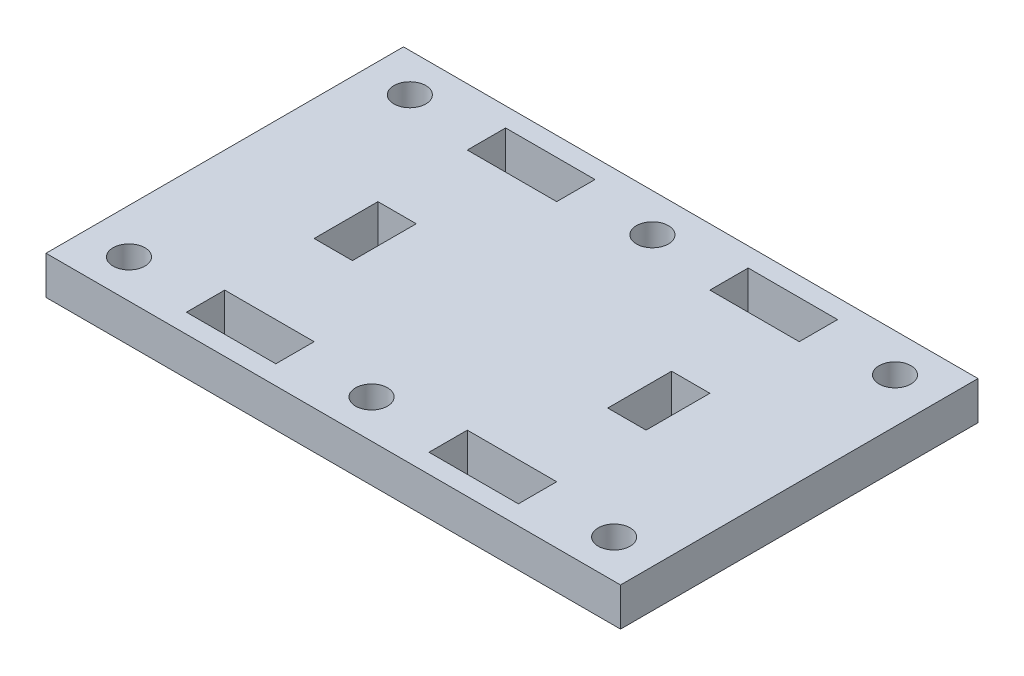
ISO-10303-21;
HEADER;
FILE_DESCRIPTION(('STEP AP214'),'2;1');
FILE_NAME('part.step','',(''),(''),'','','');
FILE_SCHEMA(('AUTOMOTIVE_DESIGN { 1 0 10303 214 1 1 1 1 }'));
ENDSEC;
DATA;
#1=APPLICATION_CONTEXT('core data for automotive mechanical design processes');
#2=APPLICATION_PROTOCOL_DEFINITION('international standard','automotive_design',2000,#1);
#3=PRODUCT_CONTEXT('',#1,'mechanical');
#4=PRODUCT('Part','Part','',(#3));
#5=PRODUCT_RELATED_PRODUCT_CATEGORY('part','',(#4));
#6=PRODUCT_DEFINITION_FORMATION('','',#4);
#7=PRODUCT_DEFINITION_CONTEXT('part definition',#1,'design');
#8=PRODUCT_DEFINITION('design','',#6,#7);
#9=PRODUCT_DEFINITION_SHAPE('','',#8);
#10=(LENGTH_UNIT() NAMED_UNIT(*) SI_UNIT(.MILLI.,.METRE.));
#11=(NAMED_UNIT(*) PLANE_ANGLE_UNIT() SI_UNIT($,.RADIAN.));
#12=(NAMED_UNIT(*) SI_UNIT($,.STERADIAN.) SOLID_ANGLE_UNIT());
#13=UNCERTAINTY_MEASURE_WITH_UNIT(LENGTH_MEASURE(1.E-05),#10,'distance_accuracy_value','');
#14=(GEOMETRIC_REPRESENTATION_CONTEXT(3) GLOBAL_UNCERTAINTY_ASSIGNED_CONTEXT((#13)) GLOBAL_UNIT_ASSIGNED_CONTEXT((#10,
#11,#12)) REPRESENTATION_CONTEXT('',''));
#15=CARTESIAN_POINT('',(0.,0.,0.));
#16=DIRECTION('',(0.,0.,1.));
#17=DIRECTION('',(1.,0.,0.));
#18=AXIS2_PLACEMENT_3D('',#15,#16,#17);
#19=CARTESIAN_POINT('',(0.,3.,0.));
#20=DIRECTION('',(1.,0.,0.));
#21=DIRECTION('',(0.,0.,-1.));
#22=AXIS2_PLACEMENT_3D('',#19,#20,#21);
#23=PLANE('',#22);
#24=DIRECTION('',(0.,0.,1.));
#25=VECTOR('',#24,1.);
#26=CARTESIAN_POINT('',(0.,0.,0.));
#27=LINE('',#26,#25);
#28=CARTESIAN_POINT('',(0.,0.,-28.));
#29=VERTEX_POINT('',#28);
#30=CARTESIAN_POINT('',(0.,0.,0.));
#31=VERTEX_POINT('',#30);
#32=EDGE_CURVE('E448',#29,#31,#27,.T.);
#33=ORIENTED_EDGE('',*,*,#32,.T.);
#34=DIRECTION('',(0.,-1.,0.));
#35=VECTOR('',#34,1.);
#36=CARTESIAN_POINT('',(0.,3.,0.));
#37=LINE('',#36,#35);
#38=CARTESIAN_POINT('',(0.,3.,0.));
#39=VERTEX_POINT('',#38);
#40=EDGE_CURVE('E11',#39,#31,#37,.T.);
#41=ORIENTED_EDGE('',*,*,#40,.F.);
#42=DIRECTION('',(0.,0.,1.));
#43=VECTOR('',#42,1.);
#44=CARTESIAN_POINT('',(0.,3.,0.));
#45=LINE('',#44,#43);
#46=CARTESIAN_POINT('',(0.,3.,-28.));
#47=VERTEX_POINT('',#46);
#48=EDGE_CURVE('E451',#47,#39,#45,.T.);
#49=ORIENTED_EDGE('',*,*,#48,.F.);
#50=DIRECTION('',(0.,-1.,0.));
#51=VECTOR('',#50,1.);
#52=CARTESIAN_POINT('',(0.,3.,-28.));
#53=LINE('',#52,#51);
#54=EDGE_CURVE('E461',#47,#29,#53,.T.);
#55=ORIENTED_EDGE('',*,*,#54,.T.);
#56=EDGE_LOOP('',(#33,#41,#49,#55));
#57=FACE_BOUND('',#56,.T.);
#58=ADVANCED_FACE('F33',(#57),#23,.F.);
#59=CARTESIAN_POINT('',(0.,3.,0.));
#60=DIRECTION('',(0.,0.,-1.));
#61=DIRECTION('',(-1.,0.,0.));
#62=AXIS2_PLACEMENT_3D('',#59,#60,#61);
#63=PLANE('',#62);
#64=DIRECTION('',(1.,0.,0.));
#65=VECTOR('',#64,1.);
#66=CARTESIAN_POINT('',(0.,0.,0.));
#67=LINE('',#66,#65);
#68=CARTESIAN_POINT('',(45.,0.,0.));
#69=VERTEX_POINT('',#68);
#70=EDGE_CURVE('E464',#31,#69,#67,.T.);
#71=ORIENTED_EDGE('',*,*,#70,.T.);
#72=DIRECTION('',(0.,-1.,0.));
#73=VECTOR('',#72,1.);
#74=CARTESIAN_POINT('',(45.,3.,0.));
#75=LINE('',#74,#73);
#76=CARTESIAN_POINT('',(45.,3.,0.));
#77=VERTEX_POINT('',#76);
#78=EDGE_CURVE('E40',#77,#69,#75,.T.);
#79=ORIENTED_EDGE('',*,*,#78,.F.);
#80=DIRECTION('',(1.,0.,0.));
#81=VECTOR('',#80,1.);
#82=CARTESIAN_POINT('',(0.,3.,0.));
#83=LINE('',#82,#81);
#84=EDGE_CURVE('E454',#39,#77,#83,.T.);
#85=ORIENTED_EDGE('',*,*,#84,.F.);
#86=ORIENTED_EDGE('',*,*,#40,.T.);
#87=EDGE_LOOP('',(#71,#79,#85,#86));
#88=FACE_BOUND('',#87,.T.);
#89=ADVANCED_FACE('F493',(#88),#63,.F.);
#90=CARTESIAN_POINT('',(45.,3.,0.));
#91=DIRECTION('',(-1.,0.,0.));
#92=DIRECTION('',(0.,0.,1.));
#93=AXIS2_PLACEMENT_3D('',#90,#91,#92);
#94=PLANE('',#93);
#95=DIRECTION('',(0.,0.,-1.));
#96=VECTOR('',#95,1.);
#97=CARTESIAN_POINT('',(45.,0.,0.));
#98=LINE('',#97,#96);
#99=CARTESIAN_POINT('',(45.,0.,-28.));
#100=VERTEX_POINT('',#99);
#101=EDGE_CURVE('E466',#69,#100,#98,.T.);
#102=ORIENTED_EDGE('',*,*,#101,.T.);
#103=DIRECTION('',(0.,-1.,0.));
#104=VECTOR('',#103,1.);
#105=CARTESIAN_POINT('',(45.,3.,-28.));
#106=LINE('',#105,#104);
#107=CARTESIAN_POINT('',(45.,3.,-28.));
#108=VERTEX_POINT('',#107);
#109=EDGE_CURVE('E471',#108,#100,#106,.T.);
#110=ORIENTED_EDGE('',*,*,#109,.F.);
#111=DIRECTION('',(0.,0.,-1.));
#112=VECTOR('',#111,1.);
#113=CARTESIAN_POINT('',(45.,3.,0.));
#114=LINE('',#113,#112);
#115=EDGE_CURVE('E457',#77,#108,#114,.T.);
#116=ORIENTED_EDGE('',*,*,#115,.F.);
#117=ORIENTED_EDGE('',*,*,#78,.T.);
#118=EDGE_LOOP('',(#102,#110,#116,#117));
#119=FACE_BOUND('',#118,.T.);
#120=ADVANCED_FACE('F478',(#119),#94,.F.);
#121=CARTESIAN_POINT('',(0.,3.,-28.));
#122=DIRECTION('',(0.,0.,1.));
#123=DIRECTION('',(1.,0.,0.));
#124=AXIS2_PLACEMENT_3D('',#121,#122,#123);
#125=PLANE('',#124);
#126=DIRECTION('',(-1.,0.,0.));
#127=VECTOR('',#126,1.);
#128=CARTESIAN_POINT('',(0.,0.,-28.));
#129=LINE('',#128,#127);
#130=EDGE_CURVE('E455',#100,#29,#129,.T.);
#131=ORIENTED_EDGE('',*,*,#130,.T.);
#132=ORIENTED_EDGE('',*,*,#54,.F.);
#133=DIRECTION('',(-1.,0.,0.));
#134=VECTOR('',#133,1.);
#135=CARTESIAN_POINT('',(0.,3.,-28.));
#136=LINE('',#135,#134);
#137=EDGE_CURVE('E459',#108,#47,#136,.T.);
#138=ORIENTED_EDGE('',*,*,#137,.F.);
#139=ORIENTED_EDGE('',*,*,#109,.T.);
#140=EDGE_LOOP('',(#131,#132,#138,#139));
#141=FACE_BOUND('',#140,.T.);
#142=ADVANCED_FACE('F486',(#141),#125,.F.);
#143=CARTESIAN_POINT('',(0.,3.,0.));
#144=DIRECTION('',(0.,-1.,0.));
#145=DIRECTION('',(0.,0.,-1.));
#146=AXIS2_PLACEMENT_3D('',#143,#144,#145);
#147=PLANE('',#146);
#148=DIRECTION('',(1.,0.,0.));
#149=VECTOR('',#148,1.);
#150=CARTESIAN_POINT('',(9.49999999999999,3.,-11.5));
#151=LINE('',#150,#149);
#152=CARTESIAN_POINT('',(9.49999999999999,3.,-11.5));
#153=VERTEX_POINT('',#152);
#154=CARTESIAN_POINT('',(12.5,3.,-11.5));
#155=VERTEX_POINT('',#154);
#156=EDGE_CURVE('E247',#153,#155,#151,.T.);
#157=ORIENTED_EDGE('',*,*,#156,.F.);
#158=DIRECTION('',(0.,0.,1.));
#159=VECTOR('',#158,1.);
#160=CARTESIAN_POINT('',(9.49999999999999,3.,-11.5));
#161=LINE('',#160,#159);
#162=CARTESIAN_POINT('',(9.49999999999999,3.,-16.5));
#163=VERTEX_POINT('',#162);
#164=EDGE_CURVE('E47',#163,#153,#161,.T.);
#165=ORIENTED_EDGE('',*,*,#164,.F.);
#166=DIRECTION('',(-1.,0.,0.));
#167=VECTOR('',#166,1.);
#168=CARTESIAN_POINT('',(9.49999999999999,3.,-16.5));
#169=LINE('',#168,#167);
#170=CARTESIAN_POINT('',(12.5,3.,-16.5));
#171=VERTEX_POINT('',#170);
#172=EDGE_CURVE('E238',#171,#163,#169,.T.);
#173=ORIENTED_EDGE('',*,*,#172,.F.);
#174=DIRECTION('',(0.,0.,-1.));
#175=VECTOR('',#174,1.);
#176=CARTESIAN_POINT('',(12.5,3.,-11.5));
#177=LINE('',#176,#175);
#178=EDGE_CURVE('E241',#155,#171,#177,.T.);
#179=ORIENTED_EDGE('',*,*,#178,.F.);
#180=EDGE_LOOP('',(#157,#165,#173,#179));
#181=FACE_BOUND('',#180,.T.);
#182=DIRECTION('',(-1.,0.,0.));
#183=VECTOR('',#182,1.);
#184=CARTESIAN_POINT('',(35.5,3.,-16.5));
#185=LINE('',#184,#183);
#186=CARTESIAN_POINT('',(35.5,3.,-16.5));
#187=VERTEX_POINT('',#186);
#188=CARTESIAN_POINT('',(32.5,3.,-16.5));
#189=VERTEX_POINT('',#188);
#190=EDGE_CURVE('E273',#187,#189,#185,.T.);
#191=ORIENTED_EDGE('',*,*,#190,.F.);
#192=DIRECTION('',(0.,0.,-1.));
#193=VECTOR('',#192,1.);
#194=CARTESIAN_POINT('',(35.5,3.,-11.5));
#195=LINE('',#194,#193);
#196=CARTESIAN_POINT('',(35.5,3.,-11.5));
#197=VERTEX_POINT('',#196);
#198=EDGE_CURVE('E55',#197,#187,#195,.T.);
#199=ORIENTED_EDGE('',*,*,#198,.F.);
#200=DIRECTION('',(1.,0.,0.));
#201=VECTOR('',#200,1.);
#202=CARTESIAN_POINT('',(35.5,3.,-11.5));
#203=LINE('',#202,#201);
#204=CARTESIAN_POINT('',(32.5,3.,-11.5));
#205=VERTEX_POINT('',#204);
#206=EDGE_CURVE('E262',#205,#197,#203,.T.);
#207=ORIENTED_EDGE('',*,*,#206,.F.);
#208=DIRECTION('',(0.,0.,1.));
#209=VECTOR('',#208,1.);
#210=CARTESIAN_POINT('',(32.5,3.,-11.5));
#211=LINE('',#210,#209);
#212=EDGE_CURVE('E276',#189,#205,#211,.T.);
#213=ORIENTED_EDGE('',*,*,#212,.F.);
#214=EDGE_LOOP('',(#191,#199,#207,#213));
#215=FACE_BOUND('',#214,.T.);
#216=CARTESIAN_POINT('',(41.5,3.,-25.));
#217=DIRECTION('',(0.,1.,0.));
#218=DIRECTION('',(0.,0.,1.));
#219=AXIS2_PLACEMENT_3D('',#216,#217,#218);
#220=CIRCLE('',#219,1.25);
#221=CARTESIAN_POINT('',(41.5,3.,-23.75));
#222=VERTEX_POINT('',#221);
#223=EDGE_CURVE('E387',#222,#222,#220,.T.);
#224=ORIENTED_EDGE('',*,*,#223,.F.);
#225=EDGE_LOOP('',(#224));
#226=FACE_BOUND('',#225,.T.);
#227=CARTESIAN_POINT('',(3.49999999999999,3.,-25.));
#228=DIRECTION('',(0.,1.,0.));
#229=DIRECTION('',(0.,0.,-1.));
#230=AXIS2_PLACEMENT_3D('',#227,#228,#229);
#231=CIRCLE('',#230,1.25);
#232=CARTESIAN_POINT('',(3.49999999999999,3.,-26.25));
#233=VERTEX_POINT('',#232);
#234=EDGE_CURVE('E346',#233,#233,#231,.T.);
#235=ORIENTED_EDGE('',*,*,#234,.F.);
#236=EDGE_LOOP('',(#235));
#237=FACE_BOUND('',#236,.T.);
#238=DIRECTION('',(-1.,0.,0.));
#239=VECTOR('',#238,1.);
#240=CARTESIAN_POINT('',(35.5,3.,-4.5));
#241=LINE('',#240,#239);
#242=CARTESIAN_POINT('',(35.5,3.,-4.5));
#243=VERTEX_POINT('',#242);
#244=CARTESIAN_POINT('',(28.5,3.,-4.5));
#245=VERTEX_POINT('',#244);
#246=EDGE_CURVE('E335',#243,#245,#241,.T.);
#247=ORIENTED_EDGE('',*,*,#246,.F.);
#248=DIRECTION('',(0.,0.,-1.));
#249=VECTOR('',#248,1.);
#250=CARTESIAN_POINT('',(35.5,3.,-4.5));
#251=LINE('',#250,#249);
#252=CARTESIAN_POINT('',(35.5,3.,-1.5));
#253=VERTEX_POINT('',#252);
#254=EDGE_CURVE('E333',#253,#243,#251,.T.);
#255=ORIENTED_EDGE('',*,*,#254,.F.);
#256=DIRECTION('',(1.,0.,0.));
#257=VECTOR('',#256,1.);
#258=CARTESIAN_POINT('',(35.5,3.,-1.5));
#259=LINE('',#258,#257);
#260=CARTESIAN_POINT('',(28.5,3.,-1.5));
#261=VERTEX_POINT('',#260);
#262=EDGE_CURVE('E323',#261,#253,#259,.T.);
#263=ORIENTED_EDGE('',*,*,#262,.F.);
#264=DIRECTION('',(0.,0.,1.));
#265=VECTOR('',#264,1.);
#266=CARTESIAN_POINT('',(28.5,3.,-4.5));
#267=LINE('',#266,#265);
#268=EDGE_CURVE('E339',#245,#261,#267,.T.);
#269=ORIENTED_EDGE('',*,*,#268,.F.);
#270=EDGE_LOOP('',(#247,#255,#263,#269));
#271=FACE_BOUND('',#270,.T.);
#272=DIRECTION('',(0.,0.,-1.));
#273=VECTOR('',#272,1.);
#274=CARTESIAN_POINT('',(35.5,3.,-23.5));
#275=LINE('',#274,#273);
#276=CARTESIAN_POINT('',(35.5,3.,-23.5));
#277=VERTEX_POINT('',#276);
#278=CARTESIAN_POINT('',(35.5,3.,-26.5));
#279=VERTEX_POINT('',#278);
#280=EDGE_CURVE('E368',#277,#279,#275,.T.);
#281=ORIENTED_EDGE('',*,*,#280,.F.);
#282=DIRECTION('',(1.,0.,0.));
#283=VECTOR('',#282,1.);
#284=CARTESIAN_POINT('',(35.5,3.,-23.5));
#285=LINE('',#284,#283);
#286=CARTESIAN_POINT('',(28.5,3.,-23.5));
#287=VERTEX_POINT('',#286);
#288=EDGE_CURVE('E312',#287,#277,#285,.T.);
#289=ORIENTED_EDGE('',*,*,#288,.F.);
#290=DIRECTION('',(0.,0.,1.));
#291=VECTOR('',#290,1.);
#292=CARTESIAN_POINT('',(28.5,3.,-23.5));
#293=LINE('',#292,#291);
#294=CARTESIAN_POINT('',(28.5,3.,-26.5));
#295=VERTEX_POINT('',#294);
#296=EDGE_CURVE('E357',#295,#287,#293,.T.);
#297=ORIENTED_EDGE('',*,*,#296,.F.);
#298=DIRECTION('',(-1.,0.,0.));
#299=VECTOR('',#298,1.);
#300=CARTESIAN_POINT('',(35.5,3.,-26.5));
#301=LINE('',#300,#299);
#302=EDGE_CURVE('E371',#279,#295,#301,.T.);
#303=ORIENTED_EDGE('',*,*,#302,.F.);
#304=EDGE_LOOP('',(#281,#289,#297,#303));
#305=FACE_BOUND('',#304,.T.);
#306=CARTESIAN_POINT('',(22.5,3.,-25.));
#307=DIRECTION('',(0.,1.,0.));
#308=DIRECTION('',(0.,0.,-1.));
#309=AXIS2_PLACEMENT_3D('',#306,#307,#308);
#310=CIRCLE('',#309,1.25);
#311=CARTESIAN_POINT('',(22.5,3.,-26.25));
#312=VERTEX_POINT('',#311);
#313=EDGE_CURVE('E437',#312,#312,#310,.T.);
#314=ORIENTED_EDGE('',*,*,#313,.F.);
#315=EDGE_LOOP('',(#314));
#316=FACE_BOUND('',#315,.T.);
#317=CARTESIAN_POINT('',(3.5,3.,-3.));
#318=DIRECTION('',(0.,1.,0.));
#319=DIRECTION('',(0.,0.,1.));
#320=AXIS2_PLACEMENT_3D('',#317,#318,#319);
#321=CIRCLE('',#320,1.25);
#322=CARTESIAN_POINT('',(3.5,3.,-1.75));
#323=VERTEX_POINT('',#322);
#324=EDGE_CURVE('E398',#323,#323,#321,.T.);
#325=ORIENTED_EDGE('',*,*,#324,.F.);
#326=EDGE_LOOP('',(#325));
#327=FACE_BOUND('',#326,.T.);
#328=CARTESIAN_POINT('',(41.5,3.,-3.00000000000001));
#329=DIRECTION('',(0.,1.,0.));
#330=DIRECTION('',(0.,0.,-1.));
#331=AXIS2_PLACEMENT_3D('',#328,#329,#330);
#332=CIRCLE('',#331,1.25);
#333=CARTESIAN_POINT('',(41.5,3.,-4.25));
#334=VERTEX_POINT('',#333);
#335=EDGE_CURVE('E399',#334,#334,#332,.T.);
#336=ORIENTED_EDGE('',*,*,#335,.F.);
#337=EDGE_LOOP('',(#336));
#338=FACE_BOUND('',#337,.T.);
#339=DIRECTION('',(1.,0.,0.));
#340=VECTOR('',#339,1.);
#341=CARTESIAN_POINT('',(9.5,3.,-1.5));
#342=LINE('',#341,#340);
#343=CARTESIAN_POINT('',(9.5,3.,-1.5));
#344=VERTEX_POINT('',#343);
#345=CARTESIAN_POINT('',(16.5,3.,-1.5));
#346=VERTEX_POINT('',#345);
#347=EDGE_CURVE('E418',#344,#346,#342,.T.);
#348=ORIENTED_EDGE('',*,*,#347,.F.);
#349=DIRECTION('',(0.,0.,1.));
#350=VECTOR('',#349,1.);
#351=CARTESIAN_POINT('',(9.5,3.,-4.5));
#352=LINE('',#351,#350);
#353=CARTESIAN_POINT('',(9.5,3.,-4.5));
#354=VERTEX_POINT('',#353);
#355=EDGE_CURVE('E386',#354,#344,#352,.T.);
#356=ORIENTED_EDGE('',*,*,#355,.F.);
#357=DIRECTION('',(-1.,0.,0.));
#358=VECTOR('',#357,1.);
#359=CARTESIAN_POINT('',(9.5,3.,-4.5));
#360=LINE('',#359,#358);
#361=CARTESIAN_POINT('',(16.5,3.,-4.5));
#362=VERTEX_POINT('',#361);
#363=EDGE_CURVE('E407',#362,#354,#360,.T.);
#364=ORIENTED_EDGE('',*,*,#363,.F.);
#365=DIRECTION('',(0.,0.,-1.));
#366=VECTOR('',#365,1.);
#367=CARTESIAN_POINT('',(16.5,3.,-4.5));
#368=LINE('',#367,#366);
#369=EDGE_CURVE('E421',#346,#362,#368,.T.);
#370=ORIENTED_EDGE('',*,*,#369,.F.);
#371=EDGE_LOOP('',(#348,#356,#364,#370));
#372=FACE_BOUND('',#371,.T.);
#373=DIRECTION('',(1.,0.,0.));
#374=VECTOR('',#373,1.);
#375=CARTESIAN_POINT('',(9.49999999999999,3.,-23.5));
#376=LINE('',#375,#374);
#377=CARTESIAN_POINT('',(9.49999999999999,3.,-23.5));
#378=VERTEX_POINT('',#377);
#379=CARTESIAN_POINT('',(16.5,3.,-23.5));
#380=VERTEX_POINT('',#379);
#381=EDGE_CURVE('E302',#378,#380,#376,.T.);
#382=ORIENTED_EDGE('',*,*,#381,.F.);
#383=DIRECTION('',(0.,0.,1.));
#384=VECTOR('',#383,1.);
#385=CARTESIAN_POINT('',(9.49999999999999,3.,-23.5));
#386=LINE('',#385,#384);
#387=CARTESIAN_POINT('',(9.49999999999999,3.,-26.5));
#388=VERTEX_POINT('',#387);
#389=EDGE_CURVE('E254',#388,#378,#386,.T.);
#390=ORIENTED_EDGE('',*,*,#389,.F.);
#391=DIRECTION('',(-1.,0.,0.));
#392=VECTOR('',#391,1.);
#393=CARTESIAN_POINT('',(9.49999999999999,3.,-26.5));
#394=LINE('',#393,#392);
#395=CARTESIAN_POINT('',(16.5,3.,-26.5));
#396=VERTEX_POINT('',#395);
#397=EDGE_CURVE('E291',#396,#388,#394,.T.);
#398=ORIENTED_EDGE('',*,*,#397,.F.);
#399=DIRECTION('',(0.,0.,-1.));
#400=VECTOR('',#399,1.);
#401=CARTESIAN_POINT('',(16.5,3.,-23.5));
#402=LINE('',#401,#400);
#403=EDGE_CURVE('E305',#380,#396,#402,.T.);
#404=ORIENTED_EDGE('',*,*,#403,.F.);
#405=EDGE_LOOP('',(#382,#390,#398,#404));
#406=FACE_BOUND('',#405,.T.);
#407=CARTESIAN_POINT('',(22.5,3.,-3.00000000000001));
#408=DIRECTION('',(0.,1.,0.));
#409=DIRECTION('',(0.,0.,1.));
#410=AXIS2_PLACEMENT_3D('',#407,#408,#409);
#411=CIRCLE('',#410,1.25);
#412=CARTESIAN_POINT('',(22.5,3.,-1.75000000000001));
#413=VERTEX_POINT('',#412);
#414=EDGE_CURVE('E436',#413,#413,#411,.T.);
#415=ORIENTED_EDGE('',*,*,#414,.F.);
#416=EDGE_LOOP('',(#415));
#417=FACE_BOUND('',#416,.T.);
#418=ORIENTED_EDGE('',*,*,#48,.T.);
#419=ORIENTED_EDGE('',*,*,#84,.T.);
#420=ORIENTED_EDGE('',*,*,#115,.T.);
#421=ORIENTED_EDGE('',*,*,#137,.T.);
#422=EDGE_LOOP('',(#418,#419,#420,#421));
#423=FACE_BOUND('',#422,.T.);
#424=ADVANCED_FACE('F492',(#181,#215,#226,#237,#271,#305,#316,#327,#338,#372,#406,#417,#423),
#147,.F.);
#425=CARTESIAN_POINT('',(0.,0.,0.));
#426=DIRECTION('',(0.,-1.,0.));
#427=DIRECTION('',(0.,0.,-1.));
#428=AXIS2_PLACEMENT_3D('',#425,#426,#427);
#429=PLANE('',#428);
#430=DIRECTION('',(0.,0.,1.));
#431=VECTOR('',#430,1.);
#432=CARTESIAN_POINT('',(9.49999999999999,0.,-11.5));
#433=LINE('',#432,#431);
#434=CARTESIAN_POINT('',(9.49999999999999,0.,-16.5));
#435=VERTEX_POINT('',#434);
#436=CARTESIAN_POINT('',(9.49999999999999,0.,-11.5));
#437=VERTEX_POINT('',#436);
#438=EDGE_CURVE('E219',#435,#437,#433,.T.);
#439=ORIENTED_EDGE('',*,*,#438,.T.);
#440=DIRECTION('',(1.,0.,0.));
#441=VECTOR('',#440,1.);
#442=CARTESIAN_POINT('',(9.49999999999999,0.,-11.5));
#443=LINE('',#442,#441);
#444=CARTESIAN_POINT('',(12.5,0.,-11.5));
#445=VERTEX_POINT('',#444);
#446=EDGE_CURVE('E229',#437,#445,#443,.T.);
#447=ORIENTED_EDGE('',*,*,#446,.T.);
#448=DIRECTION('',(0.,0.,-1.));
#449=VECTOR('',#448,1.);
#450=CARTESIAN_POINT('',(12.5,0.,-11.5));
#451=LINE('',#450,#449);
#452=CARTESIAN_POINT('',(12.5,0.,-16.5));
#453=VERTEX_POINT('',#452);
#454=EDGE_CURVE('E233',#445,#453,#451,.T.);
#455=ORIENTED_EDGE('',*,*,#454,.T.);
#456=DIRECTION('',(-1.,0.,0.));
#457=VECTOR('',#456,1.);
#458=CARTESIAN_POINT('',(9.49999999999999,0.,-16.5));
#459=LINE('',#458,#457);
#460=EDGE_CURVE('E225',#453,#435,#459,.T.);
#461=ORIENTED_EDGE('',*,*,#460,.T.);
#462=EDGE_LOOP('',(#439,#447,#455,#461));
#463=FACE_BOUND('',#462,.T.);
#464=DIRECTION('',(0.,0.,-1.));
#465=VECTOR('',#464,1.);
#466=CARTESIAN_POINT('',(35.5,0.,-11.5));
#467=LINE('',#466,#465);
#468=CARTESIAN_POINT('',(35.5,0.,-11.5));
#469=VERTEX_POINT('',#468);
#470=CARTESIAN_POINT('',(35.5,0.,-16.5));
#471=VERTEX_POINT('',#470);
#472=EDGE_CURVE('E258',#469,#471,#467,.T.);
#473=ORIENTED_EDGE('',*,*,#472,.T.);
#474=DIRECTION('',(-1.,0.,0.));
#475=VECTOR('',#474,1.);
#476=CARTESIAN_POINT('',(35.5,0.,-16.5));
#477=LINE('',#476,#475);
#478=CARTESIAN_POINT('',(32.5,0.,-16.5));
#479=VERTEX_POINT('',#478);
#480=EDGE_CURVE('E261',#471,#479,#477,.T.);
#481=ORIENTED_EDGE('',*,*,#480,.T.);
#482=DIRECTION('',(0.,0.,1.));
#483=VECTOR('',#482,1.);
#484=CARTESIAN_POINT('',(32.5,0.,-11.5));
#485=LINE('',#484,#483);
#486=CARTESIAN_POINT('',(32.5,0.,-11.5));
#487=VERTEX_POINT('',#486);
#488=EDGE_CURVE('E265',#479,#487,#485,.T.);
#489=ORIENTED_EDGE('',*,*,#488,.T.);
#490=DIRECTION('',(1.,0.,0.));
#491=VECTOR('',#490,1.);
#492=CARTESIAN_POINT('',(35.5,0.,-11.5));
#493=LINE('',#492,#491);
#494=EDGE_CURVE('E268',#487,#469,#493,.T.);
#495=ORIENTED_EDGE('',*,*,#494,.T.);
#496=EDGE_LOOP('',(#473,#481,#489,#495));
#497=FACE_BOUND('',#496,.T.);
#498=CARTESIAN_POINT('',(41.5,0.,-25.));
#499=DIRECTION('',(0.,1.,0.));
#500=DIRECTION('',(0.,0.,1.));
#501=AXIS2_PLACEMENT_3D('',#498,#499,#500);
#502=CIRCLE('',#501,1.25);
#503=CARTESIAN_POINT('',(41.5,0.,-23.75));
#504=VERTEX_POINT('',#503);
#505=EDGE_CURVE('E383',#504,#504,#502,.T.);
#506=ORIENTED_EDGE('',*,*,#505,.T.);
#507=EDGE_LOOP('',(#506));
#508=FACE_BOUND('',#507,.T.);
#509=CARTESIAN_POINT('',(3.49999999999999,0.,-25.));
#510=DIRECTION('',(0.,1.,0.));
#511=DIRECTION('',(0.,0.,-1.));
#512=AXIS2_PLACEMENT_3D('',#509,#510,#511);
#513=CIRCLE('',#512,1.25);
#514=CARTESIAN_POINT('',(3.49999999999999,0.,-26.25));
#515=VERTEX_POINT('',#514);
#516=EDGE_CURVE('E390',#515,#515,#513,.T.);
#517=ORIENTED_EDGE('',*,*,#516,.T.);
#518=EDGE_LOOP('',(#517));
#519=FACE_BOUND('',#518,.T.);
#520=DIRECTION('',(0.,0.,-1.));
#521=VECTOR('',#520,1.);
#522=CARTESIAN_POINT('',(35.5,0.,-4.5));
#523=LINE('',#522,#521);
#524=CARTESIAN_POINT('',(35.5,0.,-1.5));
#525=VERTEX_POINT('',#524);
#526=CARTESIAN_POINT('',(35.5,0.,-4.5));
#527=VERTEX_POINT('',#526);
#528=EDGE_CURVE('E319',#525,#527,#523,.T.);
#529=ORIENTED_EDGE('',*,*,#528,.T.);
#530=DIRECTION('',(-1.,0.,0.));
#531=VECTOR('',#530,1.);
#532=CARTESIAN_POINT('',(35.5,0.,-4.5));
#533=LINE('',#532,#531);
#534=CARTESIAN_POINT('',(28.5,0.,-4.5));
#535=VERTEX_POINT('',#534);
#536=EDGE_CURVE('E322',#527,#535,#533,.T.);
#537=ORIENTED_EDGE('',*,*,#536,.T.);
#538=DIRECTION('',(0.,0.,1.));
#539=VECTOR('',#538,1.);
#540=CARTESIAN_POINT('',(28.5,0.,-4.5));
#541=LINE('',#540,#539);
#542=CARTESIAN_POINT('',(28.5,0.,-1.5));
#543=VERTEX_POINT('',#542);
#544=EDGE_CURVE('E326',#535,#543,#541,.T.);
#545=ORIENTED_EDGE('',*,*,#544,.T.);
#546=DIRECTION('',(1.,0.,0.));
#547=VECTOR('',#546,1.);
#548=CARTESIAN_POINT('',(35.5,0.,-1.5));
#549=LINE('',#548,#547);
#550=EDGE_CURVE('E329',#543,#525,#549,.T.);
#551=ORIENTED_EDGE('',*,*,#550,.T.);
#552=EDGE_LOOP('',(#529,#537,#545,#551));
#553=FACE_BOUND('',#552,.T.);
#554=DIRECTION('',(1.,0.,0.));
#555=VECTOR('',#554,1.);
#556=CARTESIAN_POINT('',(35.5,0.,-23.5));
#557=LINE('',#556,#555);
#558=CARTESIAN_POINT('',(28.5,0.,-23.5));
#559=VERTEX_POINT('',#558);
#560=CARTESIAN_POINT('',(35.5,0.,-23.5));
#561=VERTEX_POINT('',#560);
#562=EDGE_CURVE('E353',#559,#561,#557,.T.);
#563=ORIENTED_EDGE('',*,*,#562,.T.);
#564=DIRECTION('',(0.,0.,-1.));
#565=VECTOR('',#564,1.);
#566=CARTESIAN_POINT('',(35.5,0.,-23.5));
#567=LINE('',#566,#565);
#568=CARTESIAN_POINT('',(35.5,0.,-26.5));
#569=VERTEX_POINT('',#568);
#570=EDGE_CURVE('E356',#561,#569,#567,.T.);
#571=ORIENTED_EDGE('',*,*,#570,.T.);
#572=DIRECTION('',(-1.,0.,0.));
#573=VECTOR('',#572,1.);
#574=CARTESIAN_POINT('',(35.5,0.,-26.5));
#575=LINE('',#574,#573);
#576=CARTESIAN_POINT('',(28.5,0.,-26.5));
#577=VERTEX_POINT('',#576);
#578=EDGE_CURVE('E360',#569,#577,#575,.T.);
#579=ORIENTED_EDGE('',*,*,#578,.T.);
#580=DIRECTION('',(0.,0.,1.));
#581=VECTOR('',#580,1.);
#582=CARTESIAN_POINT('',(28.5,0.,-23.5));
#583=LINE('',#582,#581);
#584=EDGE_CURVE('E363',#577,#559,#583,.T.);
#585=ORIENTED_EDGE('',*,*,#584,.T.);
#586=EDGE_LOOP('',(#563,#571,#579,#585));
#587=FACE_BOUND('',#586,.T.);
#588=CARTESIAN_POINT('',(22.5,0.,-25.));
#589=DIRECTION('',(0.,1.,0.));
#590=DIRECTION('',(0.,0.,-1.));
#591=AXIS2_PLACEMENT_3D('',#588,#589,#590);
#592=CIRCLE('',#591,1.25);
#593=CARTESIAN_POINT('',(22.5,0.,-26.25));
#594=VERTEX_POINT('',#593);
#595=EDGE_CURVE('E433',#594,#594,#592,.T.);
#596=ORIENTED_EDGE('',*,*,#595,.T.);
#597=EDGE_LOOP('',(#596));
#598=FACE_BOUND('',#597,.T.);
#599=CARTESIAN_POINT('',(3.5,0.,-3.));
#600=DIRECTION('',(0.,1.,0.));
#601=DIRECTION('',(0.,0.,1.));
#602=AXIS2_PLACEMENT_3D('',#599,#600,#601);
#603=CIRCLE('',#602,1.25);
#604=CARTESIAN_POINT('',(3.5,0.,-1.75));
#605=VERTEX_POINT('',#604);
#606=EDGE_CURVE('E440',#605,#605,#603,.T.);
#607=ORIENTED_EDGE('',*,*,#606,.T.);
#608=EDGE_LOOP('',(#607));
#609=FACE_BOUND('',#608,.T.);
#610=CARTESIAN_POINT('',(41.5,0.,-3.00000000000001));
#611=DIRECTION('',(0.,1.,0.));
#612=DIRECTION('',(0.,0.,-1.));
#613=AXIS2_PLACEMENT_3D('',#610,#611,#612);
#614=CIRCLE('',#613,1.25);
#615=CARTESIAN_POINT('',(41.5,0.,-4.25));
#616=VERTEX_POINT('',#615);
#617=EDGE_CURVE('E395',#616,#616,#614,.T.);
#618=ORIENTED_EDGE('',*,*,#617,.T.);
#619=EDGE_LOOP('',(#618));
#620=FACE_BOUND('',#619,.T.);
#621=DIRECTION('',(0.,0.,1.));
#622=VECTOR('',#621,1.);
#623=CARTESIAN_POINT('',(9.5,0.,-4.5));
#624=LINE('',#623,#622);
#625=CARTESIAN_POINT('',(9.5,0.,-4.5));
#626=VERTEX_POINT('',#625);
#627=CARTESIAN_POINT('',(9.5,0.,-1.5));
#628=VERTEX_POINT('',#627);
#629=EDGE_CURVE('E403',#626,#628,#624,.T.);
#630=ORIENTED_EDGE('',*,*,#629,.T.);
#631=DIRECTION('',(1.,0.,0.));
#632=VECTOR('',#631,1.);
#633=CARTESIAN_POINT('',(9.5,0.,-1.5));
#634=LINE('',#633,#632);
#635=CARTESIAN_POINT('',(16.5,0.,-1.5));
#636=VERTEX_POINT('',#635);
#637=EDGE_CURVE('E406',#628,#636,#634,.T.);
#638=ORIENTED_EDGE('',*,*,#637,.T.);
#639=DIRECTION('',(0.,0.,-1.));
#640=VECTOR('',#639,1.);
#641=CARTESIAN_POINT('',(16.5,0.,-4.5));
#642=LINE('',#641,#640);
#643=CARTESIAN_POINT('',(16.5,0.,-4.5));
#644=VERTEX_POINT('',#643);
#645=EDGE_CURVE('E410',#636,#644,#642,.T.);
#646=ORIENTED_EDGE('',*,*,#645,.T.);
#647=DIRECTION('',(-1.,0.,0.));
#648=VECTOR('',#647,1.);
#649=CARTESIAN_POINT('',(9.5,0.,-4.5));
#650=LINE('',#649,#648);
#651=EDGE_CURVE('E413',#644,#626,#650,.T.);
#652=ORIENTED_EDGE('',*,*,#651,.T.);
#653=EDGE_LOOP('',(#630,#638,#646,#652));
#654=FACE_BOUND('',#653,.T.);
#655=DIRECTION('',(0.,0.,1.));
#656=VECTOR('',#655,1.);
#657=CARTESIAN_POINT('',(9.49999999999999,0.,-23.5));
#658=LINE('',#657,#656);
#659=CARTESIAN_POINT('',(9.49999999999999,0.,-26.5));
#660=VERTEX_POINT('',#659);
#661=CARTESIAN_POINT('',(9.49999999999999,0.,-23.5));
#662=VERTEX_POINT('',#661);
#663=EDGE_CURVE('E287',#660,#662,#658,.T.);
#664=ORIENTED_EDGE('',*,*,#663,.T.);
#665=DIRECTION('',(1.,0.,0.));
#666=VECTOR('',#665,1.);
#667=CARTESIAN_POINT('',(9.49999999999999,0.,-23.5));
#668=LINE('',#667,#666);
#669=CARTESIAN_POINT('',(16.5,0.,-23.5));
#670=VERTEX_POINT('',#669);
#671=EDGE_CURVE('E290',#662,#670,#668,.T.);
#672=ORIENTED_EDGE('',*,*,#671,.T.);
#673=DIRECTION('',(0.,0.,-1.));
#674=VECTOR('',#673,1.);
#675=CARTESIAN_POINT('',(16.5,0.,-23.5));
#676=LINE('',#675,#674);
#677=CARTESIAN_POINT('',(16.5,0.,-26.5));
#678=VERTEX_POINT('',#677);
#679=EDGE_CURVE('E294',#670,#678,#676,.T.);
#680=ORIENTED_EDGE('',*,*,#679,.T.);
#681=DIRECTION('',(-1.,0.,0.));
#682=VECTOR('',#681,1.);
#683=CARTESIAN_POINT('',(9.49999999999999,0.,-26.5));
#684=LINE('',#683,#682);
#685=EDGE_CURVE('E297',#678,#660,#684,.T.);
#686=ORIENTED_EDGE('',*,*,#685,.T.);
#687=EDGE_LOOP('',(#664,#672,#680,#686));
#688=FACE_BOUND('',#687,.T.);
#689=CARTESIAN_POINT('',(22.5,0.,-3.00000000000001));
#690=DIRECTION('',(0.,1.,0.));
#691=DIRECTION('',(0.,0.,1.));
#692=AXIS2_PLACEMENT_3D('',#689,#690,#691);
#693=CIRCLE('',#692,1.25);
#694=CARTESIAN_POINT('',(22.5,0.,-1.75000000000001));
#695=VERTEX_POINT('',#694);
#696=EDGE_CURVE('E445',#695,#695,#693,.T.);
#697=ORIENTED_EDGE('',*,*,#696,.T.);
#698=EDGE_LOOP('',(#697));
#699=FACE_BOUND('',#698,.T.);
#700=ORIENTED_EDGE('',*,*,#32,.F.);
#701=ORIENTED_EDGE('',*,*,#130,.F.);
#702=ORIENTED_EDGE('',*,*,#101,.F.);
#703=ORIENTED_EDGE('',*,*,#70,.F.);
#704=EDGE_LOOP('',(#700,#701,#702,#703));
#705=FACE_BOUND('',#704,.T.);
#706=ADVANCED_FACE('F235',(#463,#497,#508,#519,#553,#587,#598,#609,#620,#654,#688,#699,#705),
#429,.T.);
#707=CARTESIAN_POINT('',(22.5,0.,-3.00000000000001));
#708=DIRECTION('',(0.,1.,0.));
#709=DIRECTION('',(0.,0.,1.));
#710=AXIS2_PLACEMENT_3D('',#707,#708,#709);
#711=CYLINDRICAL_SURFACE('',#710,1.25);
#712=ORIENTED_EDGE('',*,*,#696,.F.);
#713=EDGE_LOOP('',(#712));
#714=FACE_BOUND('',#713,.T.);
#715=ORIENTED_EDGE('',*,*,#414,.T.);
#716=EDGE_LOOP('',(#715));
#717=FACE_BOUND('',#716,.T.);
#718=ADVANCED_FACE('F505',(#714,#717),#711,.F.);
#719=CARTESIAN_POINT('',(9.49999999999999,0.,-23.5));
#720=DIRECTION('',(-1.,0.,0.));
#721=DIRECTION('',(0.,0.,1.));
#722=AXIS2_PLACEMENT_3D('',#719,#720,#721);
#723=PLANE('',#722);
#724=ORIENTED_EDGE('',*,*,#389,.T.);
#725=DIRECTION('',(0.,1.,0.));
#726=VECTOR('',#725,1.);
#727=CARTESIAN_POINT('',(9.49999999999999,0.,-23.5));
#728=LINE('',#727,#726);
#729=EDGE_CURVE('E300',#662,#378,#728,.T.);
#730=ORIENTED_EDGE('',*,*,#729,.F.);
#731=ORIENTED_EDGE('',*,*,#663,.F.);
#732=DIRECTION('',(0.,1.,0.));
#733=VECTOR('',#732,1.);
#734=CARTESIAN_POINT('',(9.49999999999999,0.,-26.5));
#735=LINE('',#734,#733);
#736=EDGE_CURVE('E310',#660,#388,#735,.T.);
#737=ORIENTED_EDGE('',*,*,#736,.T.);
#738=EDGE_LOOP('',(#724,#730,#731,#737));
#739=FACE_BOUND('',#738,.T.);
#740=ADVANCED_FACE('F511',(#739),#723,.F.);
#741=CARTESIAN_POINT('',(9.49999999999999,0.,-26.5));
#742=DIRECTION('',(0.,0.,-1.));
#743=DIRECTION('',(-1.,0.,0.));
#744=AXIS2_PLACEMENT_3D('',#741,#742,#743);
#745=PLANE('',#744);
#746=ORIENTED_EDGE('',*,*,#397,.T.);
#747=ORIENTED_EDGE('',*,*,#736,.F.);
#748=ORIENTED_EDGE('',*,*,#685,.F.);
#749=DIRECTION('',(0.,1.,0.));
#750=VECTOR('',#749,1.);
#751=CARTESIAN_POINT('',(16.5,0.,-26.5));
#752=LINE('',#751,#750);
#753=EDGE_CURVE('E313',#678,#396,#752,.T.);
#754=ORIENTED_EDGE('',*,*,#753,.T.);
#755=EDGE_LOOP('',(#746,#747,#748,#754));
#756=FACE_BOUND('',#755,.T.);
#757=ADVANCED_FACE('F585',(#756),#745,.F.);
#758=CARTESIAN_POINT('',(16.5,0.,-23.5));
#759=DIRECTION('',(1.,0.,0.));
#760=DIRECTION('',(0.,0.,-1.));
#761=AXIS2_PLACEMENT_3D('',#758,#759,#760);
#762=PLANE('',#761);
#763=ORIENTED_EDGE('',*,*,#403,.T.);
#764=ORIENTED_EDGE('',*,*,#753,.F.);
#765=ORIENTED_EDGE('',*,*,#679,.F.);
#766=DIRECTION('',(0.,1.,0.));
#767=VECTOR('',#766,1.);
#768=CARTESIAN_POINT('',(16.5,0.,-23.5));
#769=LINE('',#768,#767);
#770=EDGE_CURVE('E315',#670,#380,#769,.T.);
#771=ORIENTED_EDGE('',*,*,#770,.T.);
#772=EDGE_LOOP('',(#763,#764,#765,#771));
#773=FACE_BOUND('',#772,.T.);
#774=ADVANCED_FACE('F589',(#773),#762,.F.);
#775=CARTESIAN_POINT('',(9.49999999999999,0.,-23.5));
#776=DIRECTION('',(0.,0.,1.));
#777=DIRECTION('',(1.,0.,0.));
#778=AXIS2_PLACEMENT_3D('',#775,#776,#777);
#779=PLANE('',#778);
#780=ORIENTED_EDGE('',*,*,#381,.T.);
#781=ORIENTED_EDGE('',*,*,#770,.F.);
#782=ORIENTED_EDGE('',*,*,#671,.F.);
#783=ORIENTED_EDGE('',*,*,#729,.T.);
#784=EDGE_LOOP('',(#780,#781,#782,#783));
#785=FACE_BOUND('',#784,.T.);
#786=ADVANCED_FACE('F527',(#785),#779,.F.);
#787=CARTESIAN_POINT('',(9.5,0.,-4.5));
#788=DIRECTION('',(-1.,0.,0.));
#789=DIRECTION('',(0.,0.,1.));
#790=AXIS2_PLACEMENT_3D('',#787,#788,#789);
#791=PLANE('',#790);
#792=ORIENTED_EDGE('',*,*,#355,.T.);
#793=DIRECTION('',(0.,1.,0.));
#794=VECTOR('',#793,1.);
#795=CARTESIAN_POINT('',(9.5,0.,-1.5));
#796=LINE('',#795,#794);
#797=EDGE_CURVE('E416',#628,#344,#796,.T.);
#798=ORIENTED_EDGE('',*,*,#797,.F.);
#799=ORIENTED_EDGE('',*,*,#629,.F.);
#800=DIRECTION('',(0.,1.,0.));
#801=VECTOR('',#800,1.);
#802=CARTESIAN_POINT('',(9.5,0.,-4.5));
#803=LINE('',#802,#801);
#804=EDGE_CURVE('E402',#626,#354,#803,.T.);
#805=ORIENTED_EDGE('',*,*,#804,.T.);
#806=EDGE_LOOP('',(#792,#798,#799,#805));
#807=FACE_BOUND('',#806,.T.);
#808=ADVANCED_FACE('F523',(#807),#791,.F.);
#809=CARTESIAN_POINT('',(9.5,0.,-4.5));
#810=DIRECTION('',(0.,0.,-1.));
#811=DIRECTION('',(-1.,0.,0.));
#812=AXIS2_PLACEMENT_3D('',#809,#810,#811);
#813=PLANE('',#812);
#814=ORIENTED_EDGE('',*,*,#363,.T.);
#815=ORIENTED_EDGE('',*,*,#804,.F.);
#816=ORIENTED_EDGE('',*,*,#651,.F.);
#817=DIRECTION('',(0.,1.,0.));
#818=VECTOR('',#817,1.);
#819=CARTESIAN_POINT('',(16.5,0.,-4.5));
#820=LINE('',#819,#818);
#821=EDGE_CURVE('E427',#644,#362,#820,.T.);
#822=ORIENTED_EDGE('',*,*,#821,.T.);
#823=EDGE_LOOP('',(#814,#815,#816,#822));
#824=FACE_BOUND('',#823,.T.);
#825=ADVANCED_FACE('F526',(#824),#813,.F.);
#826=CARTESIAN_POINT('',(16.5,0.,-4.5));
#827=DIRECTION('',(1.,0.,0.));
#828=DIRECTION('',(0.,0.,-1.));
#829=AXIS2_PLACEMENT_3D('',#826,#827,#828);
#830=PLANE('',#829);
#831=ORIENTED_EDGE('',*,*,#369,.T.);
#832=ORIENTED_EDGE('',*,*,#821,.F.);
#833=ORIENTED_EDGE('',*,*,#645,.F.);
#834=DIRECTION('',(0.,1.,0.));
#835=VECTOR('',#834,1.);
#836=CARTESIAN_POINT('',(16.5,0.,-1.5));
#837=LINE('',#836,#835);
#838=EDGE_CURVE('E429',#636,#346,#837,.T.);
#839=ORIENTED_EDGE('',*,*,#838,.T.);
#840=EDGE_LOOP('',(#831,#832,#833,#839));
#841=FACE_BOUND('',#840,.T.);
#842=ADVANCED_FACE('F532',(#841),#830,.F.);
#843=CARTESIAN_POINT('',(9.5,0.,-1.5));
#844=DIRECTION('',(0.,0.,1.));
#845=DIRECTION('',(1.,0.,0.));
#846=AXIS2_PLACEMENT_3D('',#843,#844,#845);
#847=PLANE('',#846);
#848=ORIENTED_EDGE('',*,*,#347,.T.);
#849=ORIENTED_EDGE('',*,*,#838,.F.);
#850=ORIENTED_EDGE('',*,*,#637,.F.);
#851=ORIENTED_EDGE('',*,*,#797,.T.);
#852=EDGE_LOOP('',(#848,#849,#850,#851));
#853=FACE_BOUND('',#852,.T.);
#854=ADVANCED_FACE('F529',(#853),#847,.F.);
#855=CARTESIAN_POINT('',(41.5,0.,-3.00000000000001));
#856=DIRECTION('',(0.,1.,0.));
#857=DIRECTION('',(0.,0.,1.));
#858=AXIS2_PLACEMENT_3D('',#855,#856,#857);
#859=CYLINDRICAL_SURFACE('',#858,1.25);
#860=ORIENTED_EDGE('',*,*,#617,.F.);
#861=EDGE_LOOP('',(#860));
#862=FACE_BOUND('',#861,.T.);
#863=ORIENTED_EDGE('',*,*,#335,.T.);
#864=EDGE_LOOP('',(#863));
#865=FACE_BOUND('',#864,.T.);
#866=ADVANCED_FACE('F517',(#862,#865),#859,.F.);
#867=CARTESIAN_POINT('',(3.5,0.,-3.));
#868=DIRECTION('',(0.,1.,0.));
#869=DIRECTION('',(0.,0.,1.));
#870=AXIS2_PLACEMENT_3D('',#867,#868,#869);
#871=CYLINDRICAL_SURFACE('',#870,1.25);
#872=ORIENTED_EDGE('',*,*,#606,.F.);
#873=EDGE_LOOP('',(#872));
#874=FACE_BOUND('',#873,.T.);
#875=ORIENTED_EDGE('',*,*,#324,.T.);
#876=EDGE_LOOP('',(#875));
#877=FACE_BOUND('',#876,.T.);
#878=ADVANCED_FACE('F513',(#874,#877),#871,.F.);
#879=CARTESIAN_POINT('',(22.5,0.,-25.));
#880=DIRECTION('',(0.,1.,0.));
#881=DIRECTION('',(0.,0.,1.));
#882=AXIS2_PLACEMENT_3D('',#879,#880,#881);
#883=CYLINDRICAL_SURFACE('',#882,1.25);
#884=ORIENTED_EDGE('',*,*,#595,.F.);
#885=EDGE_LOOP('',(#884));
#886=FACE_BOUND('',#885,.T.);
#887=ORIENTED_EDGE('',*,*,#313,.T.);
#888=EDGE_LOOP('',(#887));
#889=FACE_BOUND('',#888,.T.);
#890=ADVANCED_FACE('F516',(#886,#889),#883,.F.);
#891=CARTESIAN_POINT('',(35.5,0.,-23.5));
#892=DIRECTION('',(0.,0.,1.));
#893=DIRECTION('',(1.,0.,0.));
#894=AXIS2_PLACEMENT_3D('',#891,#892,#893);
#895=PLANE('',#894);
#896=ORIENTED_EDGE('',*,*,#288,.T.);
#897=DIRECTION('',(0.,1.,0.));
#898=VECTOR('',#897,1.);
#899=CARTESIAN_POINT('',(35.5,0.,-23.5));
#900=LINE('',#899,#898);
#901=EDGE_CURVE('E366',#561,#277,#900,.T.);
#902=ORIENTED_EDGE('',*,*,#901,.F.);
#903=ORIENTED_EDGE('',*,*,#562,.F.);
#904=DIRECTION('',(0.,1.,0.));
#905=VECTOR('',#904,1.);
#906=CARTESIAN_POINT('',(28.5,0.,-23.5));
#907=LINE('',#906,#905);
#908=EDGE_CURVE('E336',#559,#287,#907,.T.);
#909=ORIENTED_EDGE('',*,*,#908,.T.);
#910=EDGE_LOOP('',(#896,#902,#903,#909));
#911=FACE_BOUND('',#910,.T.);
#912=ADVANCED_FACE('F521',(#911),#895,.F.);
#913=CARTESIAN_POINT('',(28.5,0.,-23.5));
#914=DIRECTION('',(-1.,0.,0.));
#915=DIRECTION('',(0.,0.,1.));
#916=AXIS2_PLACEMENT_3D('',#913,#914,#915);
#917=PLANE('',#916);
#918=ORIENTED_EDGE('',*,*,#296,.T.);
#919=ORIENTED_EDGE('',*,*,#908,.F.);
#920=ORIENTED_EDGE('',*,*,#584,.F.);
#921=DIRECTION('',(0.,1.,0.));
#922=VECTOR('',#921,1.);
#923=CARTESIAN_POINT('',(28.5,0.,-26.5));
#924=LINE('',#923,#922);
#925=EDGE_CURVE('E377',#577,#295,#924,.T.);
#926=ORIENTED_EDGE('',*,*,#925,.T.);
#927=EDGE_LOOP('',(#918,#919,#920,#926));
#928=FACE_BOUND('',#927,.T.);
#929=ADVANCED_FACE('F555',(#928),#917,.F.);
#930=CARTESIAN_POINT('',(35.5,0.,-26.5));
#931=DIRECTION('',(0.,0.,-1.));
#932=DIRECTION('',(-1.,0.,0.));
#933=AXIS2_PLACEMENT_3D('',#930,#931,#932);
#934=PLANE('',#933);
#935=ORIENTED_EDGE('',*,*,#302,.T.);
#936=ORIENTED_EDGE('',*,*,#925,.F.);
#937=ORIENTED_EDGE('',*,*,#578,.F.);
#938=DIRECTION('',(0.,1.,0.));
#939=VECTOR('',#938,1.);
#940=CARTESIAN_POINT('',(35.5,0.,-26.5));
#941=LINE('',#940,#939);
#942=EDGE_CURVE('E379',#569,#279,#941,.T.);
#943=ORIENTED_EDGE('',*,*,#942,.T.);
#944=EDGE_LOOP('',(#935,#936,#937,#943));
#945=FACE_BOUND('',#944,.T.);
#946=ADVANCED_FACE('F561',(#945),#934,.F.);
#947=CARTESIAN_POINT('',(35.5,0.,-23.5));
#948=DIRECTION('',(1.,0.,0.));
#949=DIRECTION('',(0.,0.,-1.));
#950=AXIS2_PLACEMENT_3D('',#947,#948,#949);
#951=PLANE('',#950);
#952=ORIENTED_EDGE('',*,*,#280,.T.);
#953=ORIENTED_EDGE('',*,*,#942,.F.);
#954=ORIENTED_EDGE('',*,*,#570,.F.);
#955=ORIENTED_EDGE('',*,*,#901,.T.);
#956=EDGE_LOOP('',(#952,#953,#954,#955));
#957=FACE_BOUND('',#956,.T.);
#958=ADVANCED_FACE('F557',(#957),#951,.F.);
#959=CARTESIAN_POINT('',(35.5,0.,-4.5));
#960=DIRECTION('',(1.,0.,0.));
#961=DIRECTION('',(0.,0.,-1.));
#962=AXIS2_PLACEMENT_3D('',#959,#960,#961);
#963=PLANE('',#962);
#964=ORIENTED_EDGE('',*,*,#254,.T.);
#965=DIRECTION('',(0.,1.,0.));
#966=VECTOR('',#965,1.);
#967=CARTESIAN_POINT('',(35.5,0.,-4.5));
#968=LINE('',#967,#966);
#969=EDGE_CURVE('E332',#527,#243,#968,.T.);
#970=ORIENTED_EDGE('',*,*,#969,.F.);
#971=ORIENTED_EDGE('',*,*,#528,.F.);
#972=DIRECTION('',(0.,1.,0.));
#973=VECTOR('',#972,1.);
#974=CARTESIAN_POINT('',(35.5,0.,-1.5));
#975=LINE('',#974,#973);
#976=EDGE_CURVE('E344',#525,#253,#975,.T.);
#977=ORIENTED_EDGE('',*,*,#976,.T.);
#978=EDGE_LOOP('',(#964,#970,#971,#977));
#979=FACE_BOUND('',#978,.T.);
#980=ADVANCED_FACE('F560',(#979),#963,.F.);
#981=CARTESIAN_POINT('',(35.5,0.,-1.5));
#982=DIRECTION('',(0.,0.,1.));
#983=DIRECTION('',(1.,0.,0.));
#984=AXIS2_PLACEMENT_3D('',#981,#982,#983);
#985=PLANE('',#984);
#986=ORIENTED_EDGE('',*,*,#262,.T.);
#987=ORIENTED_EDGE('',*,*,#976,.F.);
#988=ORIENTED_EDGE('',*,*,#550,.F.);
#989=DIRECTION('',(0.,1.,0.));
#990=VECTOR('',#989,1.);
#991=CARTESIAN_POINT('',(28.5,0.,-1.5));
#992=LINE('',#991,#990);
#993=EDGE_CURVE('E347',#543,#261,#992,.T.);
#994=ORIENTED_EDGE('',*,*,#993,.T.);
#995=EDGE_LOOP('',(#986,#987,#988,#994));
#996=FACE_BOUND('',#995,.T.);
#997=ADVANCED_FACE('F571',(#996),#985,.F.);
#998=CARTESIAN_POINT('',(28.5,0.,-4.5));
#999=DIRECTION('',(-1.,0.,0.));
#1000=DIRECTION('',(0.,0.,1.));
#1001=AXIS2_PLACEMENT_3D('',#998,#999,#1000);
#1002=PLANE('',#1001);
#1003=ORIENTED_EDGE('',*,*,#268,.T.);
#1004=ORIENTED_EDGE('',*,*,#993,.F.);
#1005=ORIENTED_EDGE('',*,*,#544,.F.);
#1006=DIRECTION('',(0.,1.,0.));
#1007=VECTOR('',#1006,1.);
#1008=CARTESIAN_POINT('',(28.5,0.,-4.5));
#1009=LINE('',#1008,#1007);
#1010=EDGE_CURVE('E349',#535,#245,#1009,.T.);
#1011=ORIENTED_EDGE('',*,*,#1010,.T.);
#1012=EDGE_LOOP('',(#1003,#1004,#1005,#1011));
#1013=FACE_BOUND('',#1012,.T.);
#1014=ADVANCED_FACE('F575',(#1013),#1002,.F.);
#1015=CARTESIAN_POINT('',(35.5,0.,-4.5));
#1016=DIRECTION('',(0.,0.,-1.));
#1017=DIRECTION('',(-1.,0.,0.));
#1018=AXIS2_PLACEMENT_3D('',#1015,#1016,#1017);
#1019=PLANE('',#1018);
#1020=ORIENTED_EDGE('',*,*,#246,.T.);
#1021=ORIENTED_EDGE('',*,*,#1010,.F.);
#1022=ORIENTED_EDGE('',*,*,#536,.F.);
#1023=ORIENTED_EDGE('',*,*,#969,.T.);
#1024=EDGE_LOOP('',(#1020,#1021,#1022,#1023));
#1025=FACE_BOUND('',#1024,.T.);
#1026=ADVANCED_FACE('F547',(#1025),#1019,.F.);
#1027=CARTESIAN_POINT('',(3.49999999999999,0.,-25.));
#1028=DIRECTION('',(0.,1.,0.));
#1029=DIRECTION('',(0.,0.,1.));
#1030=AXIS2_PLACEMENT_3D('',#1027,#1028,#1029);
#1031=CYLINDRICAL_SURFACE('',#1030,1.25);
#1032=ORIENTED_EDGE('',*,*,#516,.F.);
#1033=EDGE_LOOP('',(#1032));
#1034=FACE_BOUND('',#1033,.T.);
#1035=ORIENTED_EDGE('',*,*,#234,.T.);
#1036=EDGE_LOOP('',(#1035));
#1037=FACE_BOUND('',#1036,.T.);
#1038=ADVANCED_FACE('F543',(#1034,#1037),#1031,.F.);
#1039=CARTESIAN_POINT('',(41.5,0.,-25.));
#1040=DIRECTION('',(0.,1.,0.));
#1041=DIRECTION('',(0.,0.,1.));
#1042=AXIS2_PLACEMENT_3D('',#1039,#1040,#1041);
#1043=CYLINDRICAL_SURFACE('',#1042,1.25);
#1044=ORIENTED_EDGE('',*,*,#505,.F.);
#1045=EDGE_LOOP('',(#1044));
#1046=FACE_BOUND('',#1045,.T.);
#1047=ORIENTED_EDGE('',*,*,#223,.T.);
#1048=EDGE_LOOP('',(#1047));
#1049=FACE_BOUND('',#1048,.T.);
#1050=ADVANCED_FACE('F546',(#1046,#1049),#1043,.F.);
#1051=CARTESIAN_POINT('',(35.5,0.,-11.5));
#1052=DIRECTION('',(1.,0.,0.));
#1053=DIRECTION('',(0.,0.,-1.));
#1054=AXIS2_PLACEMENT_3D('',#1051,#1052,#1053);
#1055=PLANE('',#1054);
#1056=ORIENTED_EDGE('',*,*,#198,.T.);
#1057=DIRECTION('',(0.,1.,0.));
#1058=VECTOR('',#1057,1.);
#1059=CARTESIAN_POINT('',(35.5,0.,-16.5));
#1060=LINE('',#1059,#1058);
#1061=EDGE_CURVE('E271',#471,#187,#1060,.T.);
#1062=ORIENTED_EDGE('',*,*,#1061,.F.);
#1063=ORIENTED_EDGE('',*,*,#472,.F.);
#1064=DIRECTION('',(0.,1.,0.));
#1065=VECTOR('',#1064,1.);
#1066=CARTESIAN_POINT('',(35.5,0.,-11.5));
#1067=LINE('',#1066,#1065);
#1068=EDGE_CURVE('E248',#469,#197,#1067,.T.);
#1069=ORIENTED_EDGE('',*,*,#1068,.T.);
#1070=EDGE_LOOP('',(#1056,#1062,#1063,#1069));
#1071=FACE_BOUND('',#1070,.T.);
#1072=ADVANCED_FACE('F551',(#1071),#1055,.F.);
#1073=CARTESIAN_POINT('',(35.5,0.,-11.5));
#1074=DIRECTION('',(0.,0.,1.));
#1075=DIRECTION('',(1.,0.,0.));
#1076=AXIS2_PLACEMENT_3D('',#1073,#1074,#1075);
#1077=PLANE('',#1076);
#1078=ORIENTED_EDGE('',*,*,#206,.T.);
#1079=ORIENTED_EDGE('',*,*,#1068,.F.);
#1080=ORIENTED_EDGE('',*,*,#494,.F.);
#1081=DIRECTION('',(0.,1.,0.));
#1082=VECTOR('',#1081,1.);
#1083=CARTESIAN_POINT('',(32.5,0.,-11.5));
#1084=LINE('',#1083,#1082);
#1085=EDGE_CURVE('E282',#487,#205,#1084,.T.);
#1086=ORIENTED_EDGE('',*,*,#1085,.T.);
#1087=EDGE_LOOP('',(#1078,#1079,#1080,#1086));
#1088=FACE_BOUND('',#1087,.T.);
#1089=ADVANCED_FACE('F599',(#1088),#1077,.F.);
#1090=CARTESIAN_POINT('',(32.5,0.,-11.5));
#1091=DIRECTION('',(-1.,0.,0.));
#1092=DIRECTION('',(0.,0.,1.));
#1093=AXIS2_PLACEMENT_3D('',#1090,#1091,#1092);
#1094=PLANE('',#1093);
#1095=ORIENTED_EDGE('',*,*,#212,.T.);
#1096=ORIENTED_EDGE('',*,*,#1085,.F.);
#1097=ORIENTED_EDGE('',*,*,#488,.F.);
#1098=DIRECTION('',(0.,1.,0.));
#1099=VECTOR('',#1098,1.);
#1100=CARTESIAN_POINT('',(32.5,0.,-16.5));
#1101=LINE('',#1100,#1099);
#1102=EDGE_CURVE('E284',#479,#189,#1101,.T.);
#1103=ORIENTED_EDGE('',*,*,#1102,.T.);
#1104=EDGE_LOOP('',(#1095,#1096,#1097,#1103));
#1105=FACE_BOUND('',#1104,.T.);
#1106=ADVANCED_FACE('F603',(#1105),#1094,.F.);
#1107=CARTESIAN_POINT('',(35.5,0.,-16.5));
#1108=DIRECTION('',(0.,0.,-1.));
#1109=DIRECTION('',(-1.,0.,0.));
#1110=AXIS2_PLACEMENT_3D('',#1107,#1108,#1109);
#1111=PLANE('',#1110);
#1112=ORIENTED_EDGE('',*,*,#190,.T.);
#1113=ORIENTED_EDGE('',*,*,#1102,.F.);
#1114=ORIENTED_EDGE('',*,*,#480,.F.);
#1115=ORIENTED_EDGE('',*,*,#1061,.T.);
#1116=EDGE_LOOP('',(#1112,#1113,#1114,#1115));
#1117=FACE_BOUND('',#1116,.T.);
#1118=ADVANCED_FACE('F600',(#1117),#1111,.F.);
#1119=CARTESIAN_POINT('',(9.49999999999999,0.,-11.5));
#1120=DIRECTION('',(-1.,0.,0.));
#1121=DIRECTION('',(0.,0.,1.));
#1122=AXIS2_PLACEMENT_3D('',#1119,#1120,#1121);
#1123=PLANE('',#1122);
#1124=ORIENTED_EDGE('',*,*,#164,.T.);
#1125=DIRECTION('',(0.,1.,0.));
#1126=VECTOR('',#1125,1.);
#1127=CARTESIAN_POINT('',(9.49999999999999,0.,-11.5));
#1128=LINE('',#1127,#1126);
#1129=EDGE_CURVE('E215',#437,#153,#1128,.T.);
#1130=ORIENTED_EDGE('',*,*,#1129,.F.);
#1131=ORIENTED_EDGE('',*,*,#438,.F.);
#1132=DIRECTION('',(0.,1.,0.));
#1133=VECTOR('',#1132,1.);
#1134=CARTESIAN_POINT('',(9.49999999999999,0.,-16.5));
#1135=LINE('',#1134,#1133);
#1136=EDGE_CURVE('E252',#435,#163,#1135,.T.);
#1137=ORIENTED_EDGE('',*,*,#1136,.T.);
#1138=EDGE_LOOP('',(#1124,#1130,#1131,#1137));
#1139=FACE_BOUND('',#1138,.T.);
#1140=ADVANCED_FACE('F217',(#1139),#1123,.F.);
#1141=CARTESIAN_POINT('',(9.49999999999999,0.,-16.5));
#1142=DIRECTION('',(0.,0.,-1.));
#1143=DIRECTION('',(-1.,0.,0.));
#1144=AXIS2_PLACEMENT_3D('',#1141,#1142,#1143);
#1145=PLANE('',#1144);
#1146=ORIENTED_EDGE('',*,*,#172,.T.);
#1147=ORIENTED_EDGE('',*,*,#1136,.F.);
#1148=ORIENTED_EDGE('',*,*,#460,.F.);
#1149=DIRECTION('',(0.,1.,0.));
#1150=VECTOR('',#1149,1.);
#1151=CARTESIAN_POINT('',(12.5,0.,-16.5));
#1152=LINE('',#1151,#1150);
#1153=EDGE_CURVE('E255',#453,#171,#1152,.T.);
#1154=ORIENTED_EDGE('',*,*,#1153,.T.);
#1155=EDGE_LOOP('',(#1146,#1147,#1148,#1154));
#1156=FACE_BOUND('',#1155,.T.);
#1157=ADVANCED_FACE('F613',(#1156),#1145,.F.);
#1158=CARTESIAN_POINT('',(12.5,0.,-11.5));
#1159=DIRECTION('',(1.,0.,0.));
#1160=DIRECTION('',(0.,0.,-1.));
#1161=AXIS2_PLACEMENT_3D('',#1158,#1159,#1160);
#1162=PLANE('',#1161);
#1163=ORIENTED_EDGE('',*,*,#178,.T.);
#1164=ORIENTED_EDGE('',*,*,#1153,.F.);
#1165=ORIENTED_EDGE('',*,*,#454,.F.);
#1166=DIRECTION('',(0.,1.,0.));
#1167=VECTOR('',#1166,1.);
#1168=CARTESIAN_POINT('',(12.5,0.,-11.5));
#1169=LINE('',#1168,#1167);
#1170=EDGE_CURVE('E224',#445,#155,#1169,.T.);
#1171=ORIENTED_EDGE('',*,*,#1170,.T.);
#1172=EDGE_LOOP('',(#1163,#1164,#1165,#1171));
#1173=FACE_BOUND('',#1172,.T.);
#1174=ADVANCED_FACE('F616',(#1173),#1162,.F.);
#1175=CARTESIAN_POINT('',(9.49999999999999,0.,-11.5));
#1176=DIRECTION('',(0.,0.,1.));
#1177=DIRECTION('',(1.,0.,0.));
#1178=AXIS2_PLACEMENT_3D('',#1175,#1176,#1177);
#1179=PLANE('',#1178);
#1180=ORIENTED_EDGE('',*,*,#156,.T.);
#1181=ORIENTED_EDGE('',*,*,#1170,.F.);
#1182=ORIENTED_EDGE('',*,*,#446,.F.);
#1183=ORIENTED_EDGE('',*,*,#1129,.T.);
#1184=EDGE_LOOP('',(#1180,#1181,#1182,#1183));
#1185=FACE_BOUND('',#1184,.T.);
#1186=ADVANCED_FACE('F230',(#1185),#1179,.F.);
#1187=CLOSED_SHELL('',(#58,#89,#120,#142,#424,#706,#718,#740,#757,#774,#786,#808,#825,#842,#854,
#866,#878,#890,#912,#929,#946,#958,#980,#997,#1014,#1026,#1038,#1050,#1072,#1089,#1106,#1118,
#1140,#1157,#1174,#1186));
#1188=MANIFOLD_SOLID_BREP('B2',#1187);
#1189=ADVANCED_BREP_SHAPE_REPRESENTATION('',(#18,#1188),#14);
#1190=SHAPE_DEFINITION_REPRESENTATION(#9,#1189);
ENDSEC;
END-ISO-10303-21;
